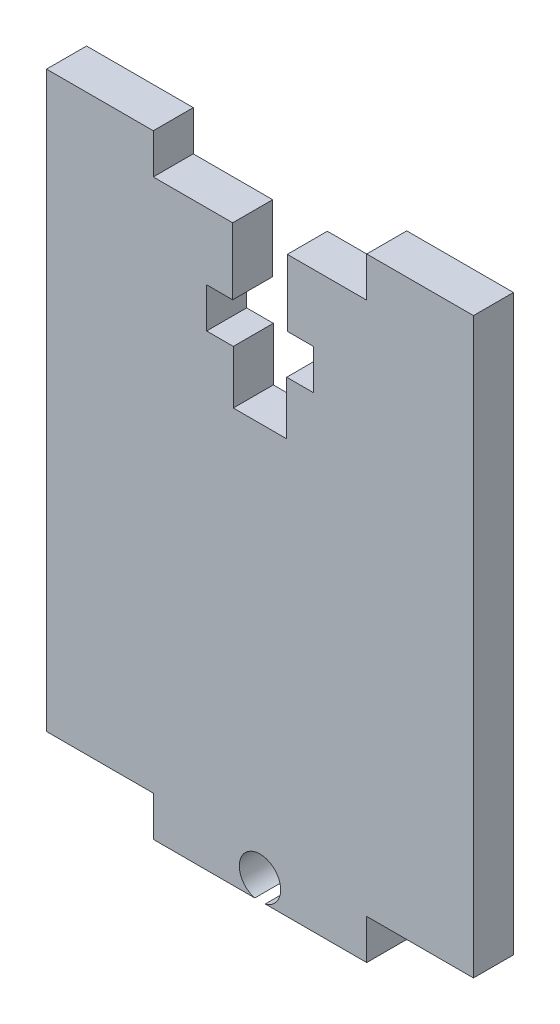
ISO-10303-21;
HEADER;
FILE_DESCRIPTION(('STEP AP214'),'2;1');
FILE_NAME('part.step','',(''),(''),'','','');
FILE_SCHEMA(('AUTOMOTIVE_DESIGN { 1 0 10303 214 1 1 1 1 }'));
ENDSEC;
DATA;
#1=APPLICATION_CONTEXT('core data for automotive mechanical design processes');
#2=APPLICATION_PROTOCOL_DEFINITION('international standard','automotive_design',2000,#1);
#3=PRODUCT_CONTEXT('',#1,'mechanical');
#4=PRODUCT('Part','Part','',(#3));
#5=PRODUCT_RELATED_PRODUCT_CATEGORY('part','',(#4));
#6=PRODUCT_DEFINITION_FORMATION('','',#4);
#7=PRODUCT_DEFINITION_CONTEXT('part definition',#1,'design');
#8=PRODUCT_DEFINITION('design','',#6,#7);
#9=PRODUCT_DEFINITION_SHAPE('','',#8);
#10=(LENGTH_UNIT() NAMED_UNIT(*) SI_UNIT(.MILLI.,.METRE.));
#11=(NAMED_UNIT(*) PLANE_ANGLE_UNIT() SI_UNIT($,.RADIAN.));
#12=(NAMED_UNIT(*) SI_UNIT($,.STERADIAN.) SOLID_ANGLE_UNIT());
#13=UNCERTAINTY_MEASURE_WITH_UNIT(LENGTH_MEASURE(1.E-05),#10,'distance_accuracy_value','');
#14=(GEOMETRIC_REPRESENTATION_CONTEXT(3) GLOBAL_UNCERTAINTY_ASSIGNED_CONTEXT((#13)) GLOBAL_UNIT_ASSIGNED_CONTEXT((#10,
#11,#12)) REPRESENTATION_CONTEXT('',''));
#15=CARTESIAN_POINT('',(0.,0.,0.));
#16=DIRECTION('',(0.,0.,1.));
#17=DIRECTION('',(1.,0.,0.));
#18=AXIS2_PLACEMENT_3D('',#15,#16,#17);
#19=CARTESIAN_POINT('',(8.,48.8553054771042,3.));
#20=DIRECTION('',(1.,0.,0.));
#21=DIRECTION('',(0.,0.,-1.));
#22=AXIS2_PLACEMENT_3D('',#19,#20,#21);
#23=PLANE('',#22);
#24=DIRECTION('',(0.,-1.,0.));
#25=VECTOR('',#24,1.);
#26=CARTESIAN_POINT('',(8.,48.8553054771042,0.));
#27=LINE('',#26,#25);
#28=CARTESIAN_POINT('',(8.,51.8553054771042,0.));
#29=VERTEX_POINT('',#28);
#30=CARTESIAN_POINT('',(8.,48.8553054771042,0.));
#31=VERTEX_POINT('',#30);
#32=EDGE_CURVE('E237',#29,#31,#27,.T.);
#33=ORIENTED_EDGE('',*,*,#32,.T.);
#34=DIRECTION('',(0.,0.,-1.));
#35=VECTOR('',#34,1.);
#36=CARTESIAN_POINT('',(8.,48.8553054771042,3.));
#37=LINE('',#36,#35);
#38=CARTESIAN_POINT('',(8.,48.8553054771042,3.));
#39=VERTEX_POINT('',#38);
#40=EDGE_CURVE('E11',#39,#31,#37,.T.);
#41=ORIENTED_EDGE('',*,*,#40,.F.);
#42=DIRECTION('',(0.,-1.,0.));
#43=VECTOR('',#42,1.);
#44=CARTESIAN_POINT('',(8.,48.8553054771042,3.));
#45=LINE('',#44,#43);
#46=CARTESIAN_POINT('',(8.,51.8553054771042,3.));
#47=VERTEX_POINT('',#46);
#48=EDGE_CURVE('E287',#47,#39,#45,.T.);
#49=ORIENTED_EDGE('',*,*,#48,.F.);
#50=DIRECTION('',(0.,0.,-1.));
#51=VECTOR('',#50,1.);
#52=CARTESIAN_POINT('',(8.,51.8553054771042,3.));
#53=LINE('',#52,#51);
#54=EDGE_CURVE('E233',#47,#29,#53,.T.);
#55=ORIENTED_EDGE('',*,*,#54,.T.);
#56=EDGE_LOOP('',(#33,#41,#49,#55));
#57=FACE_BOUND('',#56,.T.);
#58=ADVANCED_FACE('F33',(#57),#23,.F.);
#59=CARTESIAN_POINT('',(2.04789002341845,48.8553054771042,3.));
#60=DIRECTION('',(0.,-1.,0.));
#61=DIRECTION('',(0.,0.,-1.));
#62=AXIS2_PLACEMENT_3D('',#59,#60,#61);
#63=PLANE('',#62);
#64=DIRECTION('',(-1.,0.,0.));
#65=VECTOR('',#64,1.);
#66=CARTESIAN_POINT('',(2.04789002341845,48.8553054771042,0.));
#67=LINE('',#66,#65);
#68=CARTESIAN_POINT('',(2.04789002341845,48.8553054771042,0.));
#69=VERTEX_POINT('',#68);
#70=EDGE_CURVE('E240',#31,#69,#67,.T.);
#71=ORIENTED_EDGE('',*,*,#70,.T.);
#72=DIRECTION('',(0.,0.,-1.));
#73=VECTOR('',#72,1.);
#74=CARTESIAN_POINT('',(2.04789002341845,48.8553054771042,3.));
#75=LINE('',#74,#73);
#76=CARTESIAN_POINT('',(2.04789002341845,48.8553054771042,3.));
#77=VERTEX_POINT('',#76);
#78=EDGE_CURVE('E41',#77,#69,#75,.T.);
#79=ORIENTED_EDGE('',*,*,#78,.F.);
#80=DIRECTION('',(-1.,0.,0.));
#81=VECTOR('',#80,1.);
#82=CARTESIAN_POINT('',(2.04789002341845,48.8553054771042,3.));
#83=LINE('',#82,#81);
#84=EDGE_CURVE('E146',#39,#77,#83,.T.);
#85=ORIENTED_EDGE('',*,*,#84,.F.);
#86=ORIENTED_EDGE('',*,*,#40,.T.);
#87=EDGE_LOOP('',(#71,#79,#85,#86));
#88=FACE_BOUND('',#87,.T.);
#89=ADVANCED_FACE('F435',(#88),#63,.F.);
#90=CARTESIAN_POINT('',(2.04789002341845,48.8553054771042,3.));
#91=DIRECTION('',(1.,0.,0.));
#92=DIRECTION('',(0.,1.,0.));
#93=AXIS2_PLACEMENT_3D('',#90,#91,#92);
#94=PLANE('',#93);
#95=DIRECTION('',(0.,-1.,0.));
#96=VECTOR('',#95,1.);
#97=CARTESIAN_POINT('',(2.04789002341845,48.8553054771042,0.));
#98=LINE('',#97,#96);
#99=CARTESIAN_POINT('',(2.04789002341845,43.8553054771042,0.));
#100=VERTEX_POINT('',#99);
#101=EDGE_CURVE('E242',#69,#100,#98,.T.);
#102=ORIENTED_EDGE('',*,*,#101,.T.);
#103=DIRECTION('',(0.,0.,-1.));
#104=VECTOR('',#103,1.);
#105=CARTESIAN_POINT('',(2.04789002341845,43.8553054771042,3.));
#106=LINE('',#105,#104);
#107=CARTESIAN_POINT('',(2.04789002341845,43.8553054771042,3.));
#108=VERTEX_POINT('',#107);
#109=EDGE_CURVE('E348',#108,#100,#106,.T.);
#110=ORIENTED_EDGE('',*,*,#109,.F.);
#111=DIRECTION('',(0.,-1.,0.));
#112=VECTOR('',#111,1.);
#113=CARTESIAN_POINT('',(2.04789002341845,48.8553054771042,3.));
#114=LINE('',#113,#112);
#115=EDGE_CURVE('E356',#77,#108,#114,.T.);
#116=ORIENTED_EDGE('',*,*,#115,.F.);
#117=ORIENTED_EDGE('',*,*,#78,.T.);
#118=EDGE_LOOP('',(#102,#110,#116,#117));
#119=FACE_BOUND('',#118,.T.);
#120=ADVANCED_FACE('F354',(#119),#94,.F.);
#121=CARTESIAN_POINT('',(2.04789002341845,43.8553054771042,3.));
#122=DIRECTION('',(0.,1.,0.));
#123=DIRECTION('',(-1.,0.,0.));
#124=AXIS2_PLACEMENT_3D('',#121,#122,#123);
#125=PLANE('',#124);
#126=DIRECTION('',(1.,0.,0.));
#127=VECTOR('',#126,1.);
#128=CARTESIAN_POINT('',(2.04789002341845,43.8553054771042,0.));
#129=LINE('',#128,#127);
#130=CARTESIAN_POINT('',(4.,43.8553054771042,0.));
#131=VERTEX_POINT('',#130);
#132=EDGE_CURVE('E244',#100,#131,#129,.T.);
#133=ORIENTED_EDGE('',*,*,#132,.T.);
#134=DIRECTION('',(0.,0.,-1.));
#135=VECTOR('',#134,1.);
#136=CARTESIAN_POINT('',(4.,43.8553054771042,3.));
#137=LINE('',#136,#135);
#138=CARTESIAN_POINT('',(4.,43.8553054771042,3.));
#139=VERTEX_POINT('',#138);
#140=EDGE_CURVE('E345',#139,#131,#137,.T.);
#141=ORIENTED_EDGE('',*,*,#140,.F.);
#142=DIRECTION('',(1.,0.,0.));
#143=VECTOR('',#142,1.);
#144=CARTESIAN_POINT('',(2.04789002341845,43.8553054771042,3.));
#145=LINE('',#144,#143);
#146=EDGE_CURVE('E374',#108,#139,#145,.T.);
#147=ORIENTED_EDGE('',*,*,#146,.F.);
#148=ORIENTED_EDGE('',*,*,#109,.T.);
#149=EDGE_LOOP('',(#133,#141,#147,#148));
#150=FACE_BOUND('',#149,.T.);
#151=ADVANCED_FACE('F365',(#150),#125,.F.);
#152=CARTESIAN_POINT('',(4.,43.8553054771042,3.));
#153=DIRECTION('',(1.,0.,0.));
#154=DIRECTION('',(0.,1.,0.));
#155=AXIS2_PLACEMENT_3D('',#152,#153,#154);
#156=PLANE('',#155);
#157=DIRECTION('',(0.,-1.,0.));
#158=VECTOR('',#157,1.);
#159=CARTESIAN_POINT('',(4.,43.8553054771042,0.));
#160=LINE('',#159,#158);
#161=CARTESIAN_POINT('',(4.,40.8553054771042,0.));
#162=VERTEX_POINT('',#161);
#163=EDGE_CURVE('E246',#131,#162,#160,.T.);
#164=ORIENTED_EDGE('',*,*,#163,.T.);
#165=DIRECTION('',(0.,0.,-1.));
#166=VECTOR('',#165,1.);
#167=CARTESIAN_POINT('',(4.,40.8553054771042,3.));
#168=LINE('',#167,#166);
#169=CARTESIAN_POINT('',(4.,40.8553054771042,3.));
#170=VERTEX_POINT('',#169);
#171=EDGE_CURVE('E342',#170,#162,#168,.T.);
#172=ORIENTED_EDGE('',*,*,#171,.F.);
#173=DIRECTION('',(0.,-1.,0.));
#174=VECTOR('',#173,1.);
#175=CARTESIAN_POINT('',(4.,43.8553054771042,3.));
#176=LINE('',#175,#174);
#177=EDGE_CURVE('E371',#139,#170,#176,.T.);
#178=ORIENTED_EDGE('',*,*,#177,.F.);
#179=ORIENTED_EDGE('',*,*,#140,.T.);
#180=EDGE_LOOP('',(#164,#172,#178,#179));
#181=FACE_BOUND('',#180,.T.);
#182=ADVANCED_FACE('F369',(#181),#156,.F.);
#183=CARTESIAN_POINT('',(4.,40.8553054771042,3.));
#184=DIRECTION('',(0.,-1.,0.));
#185=DIRECTION('',(0.,0.,-1.));
#186=AXIS2_PLACEMENT_3D('',#183,#184,#185);
#187=PLANE('',#186);
#188=DIRECTION('',(-1.,0.,0.));
#189=VECTOR('',#188,1.);
#190=CARTESIAN_POINT('',(4.,40.8553054771042,0.));
#191=LINE('',#190,#189);
#192=CARTESIAN_POINT('',(2.,40.8553054771042,0.));
#193=VERTEX_POINT('',#192);
#194=EDGE_CURVE('E248',#162,#193,#191,.T.);
#195=ORIENTED_EDGE('',*,*,#194,.T.);
#196=DIRECTION('',(0.,0.,-1.));
#197=VECTOR('',#196,1.);
#198=CARTESIAN_POINT('',(2.,40.8553054771042,3.));
#199=LINE('',#198,#197);
#200=CARTESIAN_POINT('',(2.,40.8553054771042,3.));
#201=VERTEX_POINT('',#200);
#202=EDGE_CURVE('E339',#201,#193,#199,.T.);
#203=ORIENTED_EDGE('',*,*,#202,.F.);
#204=DIRECTION('',(-1.,0.,0.));
#205=VECTOR('',#204,1.);
#206=CARTESIAN_POINT('',(4.,40.8553054771042,3.));
#207=LINE('',#206,#205);
#208=EDGE_CURVE('E373',#170,#201,#207,.T.);
#209=ORIENTED_EDGE('',*,*,#208,.F.);
#210=ORIENTED_EDGE('',*,*,#171,.T.);
#211=EDGE_LOOP('',(#195,#203,#209,#210));
#212=FACE_BOUND('',#211,.T.);
#213=ADVANCED_FACE('F448',(#212),#187,.F.);
#214=CARTESIAN_POINT('',(2.,40.8553054771042,3.));
#215=DIRECTION('',(1.,0.,0.));
#216=DIRECTION('',(0.,1.,0.));
#217=AXIS2_PLACEMENT_3D('',#214,#215,#216);
#218=PLANE('',#217);
#219=DIRECTION('',(0.,-1.,0.));
#220=VECTOR('',#219,1.);
#221=CARTESIAN_POINT('',(2.,40.8553054771042,0.));
#222=LINE('',#221,#220);
#223=CARTESIAN_POINT('',(2.,36.8553054771042,0.));
#224=VERTEX_POINT('',#223);
#225=EDGE_CURVE('E250',#193,#224,#222,.T.);
#226=ORIENTED_EDGE('',*,*,#225,.T.);
#227=DIRECTION('',(0.,0.,-1.));
#228=VECTOR('',#227,1.);
#229=CARTESIAN_POINT('',(2.,36.8553054771042,3.));
#230=LINE('',#229,#228);
#231=CARTESIAN_POINT('',(2.,36.8553054771042,3.));
#232=VERTEX_POINT('',#231);
#233=EDGE_CURVE('E336',#232,#224,#230,.T.);
#234=ORIENTED_EDGE('',*,*,#233,.F.);
#235=DIRECTION('',(0.,-1.,0.));
#236=VECTOR('',#235,1.);
#237=CARTESIAN_POINT('',(2.,40.8553054771042,3.));
#238=LINE('',#237,#236);
#239=EDGE_CURVE('E376',#201,#232,#238,.T.);
#240=ORIENTED_EDGE('',*,*,#239,.F.);
#241=ORIENTED_EDGE('',*,*,#202,.T.);
#242=EDGE_LOOP('',(#226,#234,#240,#241));
#243=FACE_BOUND('',#242,.T.);
#244=ADVANCED_FACE('F451',(#243),#218,.F.);
#245=CARTESIAN_POINT('',(2.,36.8553054771042,3.));
#246=DIRECTION('',(0.,-1.,0.));
#247=DIRECTION('',(0.,0.,-1.));
#248=AXIS2_PLACEMENT_3D('',#245,#246,#247);
#249=PLANE('',#248);
#250=DIRECTION('',(-1.,0.,0.));
#251=VECTOR('',#250,1.);
#252=CARTESIAN_POINT('',(2.,36.8553054771042,0.));
#253=LINE('',#252,#251);
#254=CARTESIAN_POINT('',(-2.,36.8553054771042,0.));
#255=VERTEX_POINT('',#254);
#256=EDGE_CURVE('E252',#224,#255,#253,.T.);
#257=ORIENTED_EDGE('',*,*,#256,.T.);
#258=DIRECTION('',(0.,0.,-1.));
#259=VECTOR('',#258,1.);
#260=CARTESIAN_POINT('',(-2.,36.8553054771042,3.));
#261=LINE('',#260,#259);
#262=CARTESIAN_POINT('',(-2.,36.8553054771042,3.));
#263=VERTEX_POINT('',#262);
#264=EDGE_CURVE('E333',#263,#255,#261,.T.);
#265=ORIENTED_EDGE('',*,*,#264,.F.);
#266=DIRECTION('',(-1.,0.,0.));
#267=VECTOR('',#266,1.);
#268=CARTESIAN_POINT('',(2.,36.8553054771042,3.));
#269=LINE('',#268,#267);
#270=EDGE_CURVE('E382',#232,#263,#269,.T.);
#271=ORIENTED_EDGE('',*,*,#270,.F.);
#272=ORIENTED_EDGE('',*,*,#233,.T.);
#273=EDGE_LOOP('',(#257,#265,#271,#272));
#274=FACE_BOUND('',#273,.T.);
#275=ADVANCED_FACE('F455',(#274),#249,.F.);
#276=CARTESIAN_POINT('',(-2.,40.8553054771042,3.));
#277=DIRECTION('',(-1.,0.,0.));
#278=DIRECTION('',(0.,-1.,0.));
#279=AXIS2_PLACEMENT_3D('',#276,#277,#278);
#280=PLANE('',#279);
#281=DIRECTION('',(0.,1.,0.));
#282=VECTOR('',#281,1.);
#283=CARTESIAN_POINT('',(-2.,40.8553054771042,0.));
#284=LINE('',#283,#282);
#285=CARTESIAN_POINT('',(-2.,40.8553054771042,0.));
#286=VERTEX_POINT('',#285);
#287=EDGE_CURVE('E254',#255,#286,#284,.T.);
#288=ORIENTED_EDGE('',*,*,#287,.T.);
#289=DIRECTION('',(0.,0.,-1.));
#290=VECTOR('',#289,1.);
#291=CARTESIAN_POINT('',(-2.,40.8553054771042,3.));
#292=LINE('',#291,#290);
#293=CARTESIAN_POINT('',(-2.,40.8553054771042,3.));
#294=VERTEX_POINT('',#293);
#295=EDGE_CURVE('E330',#294,#286,#292,.T.);
#296=ORIENTED_EDGE('',*,*,#295,.F.);
#297=DIRECTION('',(0.,1.,0.));
#298=VECTOR('',#297,1.);
#299=CARTESIAN_POINT('',(-2.,40.8553054771042,3.));
#300=LINE('',#299,#298);
#301=EDGE_CURVE('E384',#263,#294,#300,.T.);
#302=ORIENTED_EDGE('',*,*,#301,.F.);
#303=ORIENTED_EDGE('',*,*,#264,.T.);
#304=EDGE_LOOP('',(#288,#296,#302,#303));
#305=FACE_BOUND('',#304,.T.);
#306=ADVANCED_FACE('F459',(#305),#280,.F.);
#307=CARTESIAN_POINT('',(-4.00000000000001,40.8553054771042,3.));
#308=DIRECTION('',(0.,-1.,0.));
#309=DIRECTION('',(0.,0.,-1.));
#310=AXIS2_PLACEMENT_3D('',#307,#308,#309);
#311=PLANE('',#310);
#312=DIRECTION('',(-1.,0.,0.));
#313=VECTOR('',#312,1.);
#314=CARTESIAN_POINT('',(-4.00000000000001,40.8553054771042,0.));
#315=LINE('',#314,#313);
#316=CARTESIAN_POINT('',(-4.00000000000001,40.8553054771042,0.));
#317=VERTEX_POINT('',#316);
#318=EDGE_CURVE('E256',#286,#317,#315,.T.);
#319=ORIENTED_EDGE('',*,*,#318,.T.);
#320=DIRECTION('',(0.,0.,-1.));
#321=VECTOR('',#320,1.);
#322=CARTESIAN_POINT('',(-4.00000000000001,40.8553054771042,3.));
#323=LINE('',#322,#321);
#324=CARTESIAN_POINT('',(-4.00000000000001,40.8553054771042,3.));
#325=VERTEX_POINT('',#324);
#326=EDGE_CURVE('E327',#325,#317,#323,.T.);
#327=ORIENTED_EDGE('',*,*,#326,.F.);
#328=DIRECTION('',(-1.,0.,0.));
#329=VECTOR('',#328,1.);
#330=CARTESIAN_POINT('',(-4.00000000000001,40.8553054771042,3.));
#331=LINE('',#330,#329);
#332=EDGE_CURVE('E386',#294,#325,#331,.T.);
#333=ORIENTED_EDGE('',*,*,#332,.F.);
#334=ORIENTED_EDGE('',*,*,#295,.T.);
#335=EDGE_LOOP('',(#319,#327,#333,#334));
#336=FACE_BOUND('',#335,.T.);
#337=ADVANCED_FACE('F463',(#336),#311,.F.);
#338=CARTESIAN_POINT('',(-4.,43.8553054771042,3.));
#339=DIRECTION('',(-1.,0.,0.));
#340=DIRECTION('',(0.,-1.,0.));
#341=AXIS2_PLACEMENT_3D('',#338,#339,#340);
#342=PLANE('',#341);
#343=DIRECTION('',(0.,1.,0.));
#344=VECTOR('',#343,1.);
#345=CARTESIAN_POINT('',(-4.,43.8553054771042,0.));
#346=LINE('',#345,#344);
#347=CARTESIAN_POINT('',(-4.,43.8553054771042,0.));
#348=VERTEX_POINT('',#347);
#349=EDGE_CURVE('E258',#317,#348,#346,.T.);
#350=ORIENTED_EDGE('',*,*,#349,.T.);
#351=DIRECTION('',(0.,0.,-1.));
#352=VECTOR('',#351,1.);
#353=CARTESIAN_POINT('',(-4.,43.8553054771042,3.));
#354=LINE('',#353,#352);
#355=CARTESIAN_POINT('',(-4.,43.8553054771042,3.));
#356=VERTEX_POINT('',#355);
#357=EDGE_CURVE('E324',#356,#348,#354,.T.);
#358=ORIENTED_EDGE('',*,*,#357,.F.);
#359=DIRECTION('',(0.,1.,0.));
#360=VECTOR('',#359,1.);
#361=CARTESIAN_POINT('',(-4.,43.8553054771042,3.));
#362=LINE('',#361,#360);
#363=EDGE_CURVE('E388',#325,#356,#362,.T.);
#364=ORIENTED_EDGE('',*,*,#363,.F.);
#365=ORIENTED_EDGE('',*,*,#326,.T.);
#366=EDGE_LOOP('',(#350,#358,#364,#365));
#367=FACE_BOUND('',#366,.T.);
#368=ADVANCED_FACE('F467',(#367),#342,.F.);
#369=CARTESIAN_POINT('',(-2.04789002341846,43.8553054771042,3.));
#370=DIRECTION('',(0.,1.,0.));
#371=DIRECTION('',(-1.,0.,0.));
#372=AXIS2_PLACEMENT_3D('',#369,#370,#371);
#373=PLANE('',#372);
#374=DIRECTION('',(1.,0.,0.));
#375=VECTOR('',#374,1.);
#376=CARTESIAN_POINT('',(-2.04789002341846,43.8553054771042,0.));
#377=LINE('',#376,#375);
#378=CARTESIAN_POINT('',(-2.04789002341846,43.8553054771042,0.));
#379=VERTEX_POINT('',#378);
#380=EDGE_CURVE('E260',#348,#379,#377,.T.);
#381=ORIENTED_EDGE('',*,*,#380,.T.);
#382=DIRECTION('',(0.,0.,-1.));
#383=VECTOR('',#382,1.);
#384=CARTESIAN_POINT('',(-2.04789002341846,43.8553054771042,3.));
#385=LINE('',#384,#383);
#386=CARTESIAN_POINT('',(-2.04789002341846,43.8553054771042,3.));
#387=VERTEX_POINT('',#386);
#388=EDGE_CURVE('E321',#387,#379,#385,.T.);
#389=ORIENTED_EDGE('',*,*,#388,.F.);
#390=DIRECTION('',(1.,0.,0.));
#391=VECTOR('',#390,1.);
#392=CARTESIAN_POINT('',(-2.04789002341846,43.8553054771042,3.));
#393=LINE('',#392,#391);
#394=EDGE_CURVE('E390',#356,#387,#393,.T.);
#395=ORIENTED_EDGE('',*,*,#394,.F.);
#396=ORIENTED_EDGE('',*,*,#357,.T.);
#397=EDGE_LOOP('',(#381,#389,#395,#396));
#398=FACE_BOUND('',#397,.T.);
#399=ADVANCED_FACE('F471',(#398),#373,.F.);
#400=CARTESIAN_POINT('',(-2.04789002341846,48.8553054771042,3.));
#401=DIRECTION('',(-1.,0.,0.));
#402=DIRECTION('',(0.,-1.,0.));
#403=AXIS2_PLACEMENT_3D('',#400,#401,#402);
#404=PLANE('',#403);
#405=DIRECTION('',(0.,1.,0.));
#406=VECTOR('',#405,1.);
#407=CARTESIAN_POINT('',(-2.04789002341846,48.8553054771042,0.));
#408=LINE('',#407,#406);
#409=CARTESIAN_POINT('',(-2.04789002341846,48.8553054771042,0.));
#410=VERTEX_POINT('',#409);
#411=EDGE_CURVE('E262',#379,#410,#408,.T.);
#412=ORIENTED_EDGE('',*,*,#411,.T.);
#413=DIRECTION('',(0.,0.,-1.));
#414=VECTOR('',#413,1.);
#415=CARTESIAN_POINT('',(-2.04789002341846,48.8553054771042,3.));
#416=LINE('',#415,#414);
#417=CARTESIAN_POINT('',(-2.04789002341846,48.8553054771042,3.));
#418=VERTEX_POINT('',#417);
#419=EDGE_CURVE('E318',#418,#410,#416,.T.);
#420=ORIENTED_EDGE('',*,*,#419,.F.);
#421=DIRECTION('',(0.,1.,0.));
#422=VECTOR('',#421,1.);
#423=CARTESIAN_POINT('',(-2.04789002341846,48.8553054771042,3.));
#424=LINE('',#423,#422);
#425=EDGE_CURVE('E392',#387,#418,#424,.T.);
#426=ORIENTED_EDGE('',*,*,#425,.F.);
#427=ORIENTED_EDGE('',*,*,#388,.T.);
#428=EDGE_LOOP('',(#412,#420,#426,#427));
#429=FACE_BOUND('',#428,.T.);
#430=ADVANCED_FACE('F475',(#429),#404,.F.);
#431=CARTESIAN_POINT('',(-2.04789002341846,48.8553054771042,3.));
#432=DIRECTION('',(0.,-1.,0.));
#433=DIRECTION('',(0.,0.,-1.));
#434=AXIS2_PLACEMENT_3D('',#431,#432,#433);
#435=PLANE('',#434);
#436=DIRECTION('',(-1.,0.,0.));
#437=VECTOR('',#436,1.);
#438=CARTESIAN_POINT('',(-2.04789002341846,48.8553054771042,0.));
#439=LINE('',#438,#437);
#440=CARTESIAN_POINT('',(-8.00000000000001,48.8553054771042,0.));
#441=VERTEX_POINT('',#440);
#442=EDGE_CURVE('E264',#410,#441,#439,.T.);
#443=ORIENTED_EDGE('',*,*,#442,.T.);
#444=DIRECTION('',(0.,0.,-1.));
#445=VECTOR('',#444,1.);
#446=CARTESIAN_POINT('',(-8.00000000000001,48.8553054771042,3.));
#447=LINE('',#446,#445);
#448=CARTESIAN_POINT('',(-8.00000000000001,48.8553054771042,3.));
#449=VERTEX_POINT('',#448);
#450=EDGE_CURVE('E315',#449,#441,#447,.T.);
#451=ORIENTED_EDGE('',*,*,#450,.F.);
#452=DIRECTION('',(-1.,0.,0.));
#453=VECTOR('',#452,1.);
#454=CARTESIAN_POINT('',(-2.04789002341846,48.8553054771042,3.));
#455=LINE('',#454,#453);
#456=EDGE_CURVE('E394',#418,#449,#455,.T.);
#457=ORIENTED_EDGE('',*,*,#456,.F.);
#458=ORIENTED_EDGE('',*,*,#419,.T.);
#459=EDGE_LOOP('',(#443,#451,#457,#458));
#460=FACE_BOUND('',#459,.T.);
#461=ADVANCED_FACE('F479',(#460),#435,.F.);
#462=CARTESIAN_POINT('',(-8.00000000000001,48.8553054771042,3.));
#463=DIRECTION('',(-1.,0.,0.));
#464=DIRECTION('',(0.,0.,1.));
#465=AXIS2_PLACEMENT_3D('',#462,#463,#464);
#466=PLANE('',#465);
#467=DIRECTION('',(0.,1.,0.));
#468=VECTOR('',#467,1.);
#469=CARTESIAN_POINT('',(-8.00000000000001,48.8553054771042,0.));
#470=LINE('',#469,#468);
#471=CARTESIAN_POINT('',(-8.00000000000001,51.8553054771042,0.));
#472=VERTEX_POINT('',#471);
#473=EDGE_CURVE('E266',#441,#472,#470,.T.);
#474=ORIENTED_EDGE('',*,*,#473,.T.);
#475=DIRECTION('',(0.,0.,-1.));
#476=VECTOR('',#475,1.);
#477=CARTESIAN_POINT('',(-8.00000000000001,51.8553054771042,3.));
#478=LINE('',#477,#476);
#479=CARTESIAN_POINT('',(-8.00000000000001,51.8553054771042,3.));
#480=VERTEX_POINT('',#479);
#481=EDGE_CURVE('E312',#480,#472,#478,.T.);
#482=ORIENTED_EDGE('',*,*,#481,.F.);
#483=DIRECTION('',(0.,1.,0.));
#484=VECTOR('',#483,1.);
#485=CARTESIAN_POINT('',(-8.00000000000001,48.8553054771042,3.));
#486=LINE('',#485,#484);
#487=EDGE_CURVE('E396',#449,#480,#486,.T.);
#488=ORIENTED_EDGE('',*,*,#487,.F.);
#489=ORIENTED_EDGE('',*,*,#450,.T.);
#490=EDGE_LOOP('',(#474,#482,#488,#489));
#491=FACE_BOUND('',#490,.T.);
#492=ADVANCED_FACE('F483',(#491),#466,.F.);
#493=CARTESIAN_POINT('',(-8.00000000000001,51.8553054771042,3.));
#494=DIRECTION('',(0.,-1.,0.));
#495=DIRECTION('',(0.,0.,-1.));
#496=AXIS2_PLACEMENT_3D('',#493,#494,#495);
#497=PLANE('',#496);
#498=DIRECTION('',(-1.,0.,0.));
#499=VECTOR('',#498,1.);
#500=CARTESIAN_POINT('',(-8.00000000000001,51.8553054771042,0.));
#501=LINE('',#500,#499);
#502=CARTESIAN_POINT('',(-16.,51.8553054771042,0.));
#503=VERTEX_POINT('',#502);
#504=EDGE_CURVE('E268',#472,#503,#501,.T.);
#505=ORIENTED_EDGE('',*,*,#504,.T.);
#506=DIRECTION('',(0.,0.,-1.));
#507=VECTOR('',#506,1.);
#508=CARTESIAN_POINT('',(-16.,51.8553054771042,3.));
#509=LINE('',#508,#507);
#510=CARTESIAN_POINT('',(-16.,51.8553054771042,3.));
#511=VERTEX_POINT('',#510);
#512=EDGE_CURVE('E309',#511,#503,#509,.T.);
#513=ORIENTED_EDGE('',*,*,#512,.F.);
#514=DIRECTION('',(-1.,0.,0.));
#515=VECTOR('',#514,1.);
#516=CARTESIAN_POINT('',(-8.00000000000001,51.8553054771042,3.));
#517=LINE('',#516,#515);
#518=EDGE_CURVE('E398',#480,#511,#517,.T.);
#519=ORIENTED_EDGE('',*,*,#518,.F.);
#520=ORIENTED_EDGE('',*,*,#481,.T.);
#521=EDGE_LOOP('',(#505,#513,#519,#520));
#522=FACE_BOUND('',#521,.T.);
#523=ADVANCED_FACE('F487',(#522),#497,.F.);
#524=CARTESIAN_POINT('',(-16.,51.8553054771042,3.));
#525=DIRECTION('',(1.,0.,0.));
#526=DIRECTION('',(0.,1.,0.));
#527=AXIS2_PLACEMENT_3D('',#524,#525,#526);
#528=PLANE('',#527);
#529=DIRECTION('',(0.,-1.,0.));
#530=VECTOR('',#529,1.);
#531=CARTESIAN_POINT('',(-16.,51.8553054771042,0.));
#532=LINE('',#531,#530);
#533=CARTESIAN_POINT('',(-16.,8.85530547710422,0.));
#534=VERTEX_POINT('',#533);
#535=EDGE_CURVE('E270',#503,#534,#532,.T.);
#536=ORIENTED_EDGE('',*,*,#535,.T.);
#537=DIRECTION('',(0.,0.,-1.));
#538=VECTOR('',#537,1.);
#539=CARTESIAN_POINT('',(-16.,8.85530547710422,3.));
#540=LINE('',#539,#538);
#541=CARTESIAN_POINT('',(-16.,8.85530547710422,3.));
#542=VERTEX_POINT('',#541);
#543=EDGE_CURVE('E306',#542,#534,#540,.T.);
#544=ORIENTED_EDGE('',*,*,#543,.F.);
#545=DIRECTION('',(0.,-1.,0.));
#546=VECTOR('',#545,1.);
#547=CARTESIAN_POINT('',(-16.,51.8553054771042,3.));
#548=LINE('',#547,#546);
#549=EDGE_CURVE('E400',#511,#542,#548,.T.);
#550=ORIENTED_EDGE('',*,*,#549,.F.);
#551=ORIENTED_EDGE('',*,*,#512,.T.);
#552=EDGE_LOOP('',(#536,#544,#550,#551));
#553=FACE_BOUND('',#552,.T.);
#554=ADVANCED_FACE('F491',(#553),#528,.F.);
#555=CARTESIAN_POINT('',(-16.,8.85530547710422,3.));
#556=DIRECTION('',(0.,1.,0.));
#557=DIRECTION('',(0.,0.,1.));
#558=AXIS2_PLACEMENT_3D('',#555,#556,#557);
#559=PLANE('',#558);
#560=DIRECTION('',(1.,0.,0.));
#561=VECTOR('',#560,1.);
#562=CARTESIAN_POINT('',(-16.,8.85530547710422,0.));
#563=LINE('',#562,#561);
#564=CARTESIAN_POINT('',(-8.00000000000001,8.85530547710422,0.));
#565=VERTEX_POINT('',#564);
#566=EDGE_CURVE('E272',#534,#565,#563,.T.);
#567=ORIENTED_EDGE('',*,*,#566,.T.);
#568=DIRECTION('',(0.,0.,-1.));
#569=VECTOR('',#568,1.);
#570=CARTESIAN_POINT('',(-8.00000000000001,8.85530547710422,3.));
#571=LINE('',#570,#569);
#572=CARTESIAN_POINT('',(-8.00000000000001,8.85530547710422,3.));
#573=VERTEX_POINT('',#572);
#574=EDGE_CURVE('E303',#573,#565,#571,.T.);
#575=ORIENTED_EDGE('',*,*,#574,.F.);
#576=DIRECTION('',(1.,0.,0.));
#577=VECTOR('',#576,1.);
#578=CARTESIAN_POINT('',(-16.,8.85530547710422,3.));
#579=LINE('',#578,#577);
#580=EDGE_CURVE('E402',#542,#573,#579,.T.);
#581=ORIENTED_EDGE('',*,*,#580,.F.);
#582=ORIENTED_EDGE('',*,*,#543,.T.);
#583=EDGE_LOOP('',(#567,#575,#581,#582));
#584=FACE_BOUND('',#583,.T.);
#585=ADVANCED_FACE('F495',(#584),#559,.F.);
#586=CARTESIAN_POINT('',(-8.00000000000001,5.85530547710422,3.));
#587=DIRECTION('',(1.,0.,0.));
#588=DIRECTION('',(0.,0.,-1.));
#589=AXIS2_PLACEMENT_3D('',#586,#587,#588);
#590=PLANE('',#589);
#591=DIRECTION('',(0.,-1.,0.));
#592=VECTOR('',#591,1.);
#593=CARTESIAN_POINT('',(-8.00000000000001,5.85530547710422,0.));
#594=LINE('',#593,#592);
#595=CARTESIAN_POINT('',(-8.00000000000001,5.85530547710422,0.));
#596=VERTEX_POINT('',#595);
#597=EDGE_CURVE('E274',#565,#596,#594,.T.);
#598=ORIENTED_EDGE('',*,*,#597,.T.);
#599=DIRECTION('',(0.,0.,-1.));
#600=VECTOR('',#599,1.);
#601=CARTESIAN_POINT('',(-8.00000000000001,5.85530547710422,3.));
#602=LINE('',#601,#600);
#603=CARTESIAN_POINT('',(-8.00000000000001,5.85530547710422,3.));
#604=VERTEX_POINT('',#603);
#605=EDGE_CURVE('E300',#604,#596,#602,.T.);
#606=ORIENTED_EDGE('',*,*,#605,.F.);
#607=DIRECTION('',(0.,-1.,0.));
#608=VECTOR('',#607,1.);
#609=CARTESIAN_POINT('',(-8.00000000000001,5.85530547710422,3.));
#610=LINE('',#609,#608);
#611=EDGE_CURVE('E404',#573,#604,#610,.T.);
#612=ORIENTED_EDGE('',*,*,#611,.F.);
#613=ORIENTED_EDGE('',*,*,#574,.T.);
#614=EDGE_LOOP('',(#598,#606,#612,#613));
#615=FACE_BOUND('',#614,.T.);
#616=ADVANCED_FACE('F499',(#615),#590,.F.);
#617=CARTESIAN_POINT('',(-8.00000000000001,5.85530547710422,3.));
#618=DIRECTION('',(0.,1.,0.));
#619=DIRECTION('',(0.,0.,1.));
#620=AXIS2_PLACEMENT_3D('',#617,#618,#619);
#621=PLANE('',#620);
#622=DIRECTION('',(1.,0.,0.));
#623=VECTOR('',#622,1.);
#624=CARTESIAN_POINT('',(-8.00000000000001,5.85530547710422,0.));
#625=LINE('',#624,#623);
#626=CARTESIAN_POINT('',(-0.390512483795329,5.85530547710422,0.));
#627=VERTEX_POINT('',#626);
#628=EDGE_CURVE('E276',#596,#627,#625,.T.);
#629=ORIENTED_EDGE('',*,*,#628,.T.);
#630=DIRECTION('',(0.,0.,-1.));
#631=VECTOR('',#630,1.);
#632=CARTESIAN_POINT('',(-0.390512483795329,5.85530547710422,3.));
#633=LINE('',#632,#631);
#634=CARTESIAN_POINT('',(-0.390512483795329,5.85530547710422,3.));
#635=VERTEX_POINT('',#634);
#636=EDGE_CURVE('E297',#635,#627,#633,.T.);
#637=ORIENTED_EDGE('',*,*,#636,.F.);
#638=DIRECTION('',(1.,0.,0.));
#639=VECTOR('',#638,1.);
#640=CARTESIAN_POINT('',(-8.00000000000001,5.85530547710422,3.));
#641=LINE('',#640,#639);
#642=EDGE_CURVE('E406',#604,#635,#641,.T.);
#643=ORIENTED_EDGE('',*,*,#642,.F.);
#644=ORIENTED_EDGE('',*,*,#605,.T.);
#645=EDGE_LOOP('',(#629,#637,#643,#644));
#646=FACE_BOUND('',#645,.T.);
#647=ADVANCED_FACE('F503',(#646),#621,.F.);
#648=CARTESIAN_POINT('',(0.,7.35530547710422,3.));
#649=DIRECTION('',(0.,0.,-1.));
#650=DIRECTION('',(-1.,0.,0.));
#651=AXIS2_PLACEMENT_3D('',#648,#649,#650);
#652=CYLINDRICAL_SURFACE('',#651,1.55);
#653=CARTESIAN_POINT('',(0.,7.35530547710422,0.));
#654=DIRECTION('',(0.,0.,-1.));
#655=DIRECTION('',(1.,0.,0.));
#656=AXIS2_PLACEMENT_3D('',#653,#654,#655);
#657=CIRCLE('',#656,1.55);
#658=CARTESIAN_POINT('',(0.390512483795352,5.85530547710422,0.));
#659=VERTEX_POINT('',#658);
#660=EDGE_CURVE('E278',#627,#659,#657,.T.);
#661=ORIENTED_EDGE('',*,*,#660,.T.);
#662=DIRECTION('',(0.,0.,-1.));
#663=VECTOR('',#662,1.);
#664=CARTESIAN_POINT('',(0.390512483795352,5.85530547710422,3.));
#665=LINE('',#664,#663);
#666=CARTESIAN_POINT('',(0.390512483795352,5.85530547710422,3.));
#667=VERTEX_POINT('',#666);
#668=EDGE_CURVE('E294',#667,#659,#665,.T.);
#669=ORIENTED_EDGE('',*,*,#668,.F.);
#670=CARTESIAN_POINT('',(0.,7.35530547710422,3.));
#671=DIRECTION('',(0.,0.,-1.));
#672=DIRECTION('',(1.,0.,0.));
#673=AXIS2_PLACEMENT_3D('',#670,#671,#672);
#674=CIRCLE('',#673,1.55);
#675=EDGE_CURVE('E408',#635,#667,#674,.T.);
#676=ORIENTED_EDGE('',*,*,#675,.F.);
#677=ORIENTED_EDGE('',*,*,#636,.T.);
#678=EDGE_LOOP('',(#661,#669,#676,#677));
#679=FACE_BOUND('',#678,.T.);
#680=ADVANCED_FACE('F507',(#679),#652,.F.);
#681=CARTESIAN_POINT('',(0.390512483795352,5.85530547710422,3.));
#682=DIRECTION('',(0.,1.,0.));
#683=DIRECTION('',(-1.,0.,0.));
#684=AXIS2_PLACEMENT_3D('',#681,#682,#683);
#685=PLANE('',#684);
#686=DIRECTION('',(1.,0.,0.));
#687=VECTOR('',#686,1.);
#688=CARTESIAN_POINT('',(0.390512483795352,5.85530547710422,0.));
#689=LINE('',#688,#687);
#690=CARTESIAN_POINT('',(8.00000000000004,5.85530547710422,0.));
#691=VERTEX_POINT('',#690);
#692=EDGE_CURVE('E280',#659,#691,#689,.T.);
#693=ORIENTED_EDGE('',*,*,#692,.T.);
#694=DIRECTION('',(0.,0.,-1.));
#695=VECTOR('',#694,1.);
#696=CARTESIAN_POINT('',(8.00000000000004,5.85530547710422,3.));
#697=LINE('',#696,#695);
#698=CARTESIAN_POINT('',(8.00000000000004,5.85530547710422,3.));
#699=VERTEX_POINT('',#698);
#700=EDGE_CURVE('E291',#699,#691,#697,.T.);
#701=ORIENTED_EDGE('',*,*,#700,.F.);
#702=DIRECTION('',(1.,0.,0.));
#703=VECTOR('',#702,1.);
#704=CARTESIAN_POINT('',(0.390512483795352,5.85530547710422,3.));
#705=LINE('',#704,#703);
#706=EDGE_CURVE('E410',#667,#699,#705,.T.);
#707=ORIENTED_EDGE('',*,*,#706,.F.);
#708=ORIENTED_EDGE('',*,*,#668,.T.);
#709=EDGE_LOOP('',(#693,#701,#707,#708));
#710=FACE_BOUND('',#709,.T.);
#711=ADVANCED_FACE('F416',(#710),#685,.F.);
#712=CARTESIAN_POINT('',(8.00000000000004,5.85530547710422,3.));
#713=DIRECTION('',(-1.,0.,0.));
#714=DIRECTION('',(0.,0.,1.));
#715=AXIS2_PLACEMENT_3D('',#712,#713,#714);
#716=PLANE('',#715);
#717=DIRECTION('',(0.,1.,0.));
#718=VECTOR('',#717,1.);
#719=CARTESIAN_POINT('',(8.00000000000004,5.85530547710422,0.));
#720=LINE('',#719,#718);
#721=CARTESIAN_POINT('',(8.00000000000004,8.85530547710422,0.));
#722=VERTEX_POINT('',#721);
#723=EDGE_CURVE('E282',#691,#722,#720,.T.);
#724=ORIENTED_EDGE('',*,*,#723,.T.);
#725=DIRECTION('',(0.,0.,-1.));
#726=VECTOR('',#725,1.);
#727=CARTESIAN_POINT('',(8.00000000000004,8.85530547710422,3.));
#728=LINE('',#727,#726);
#729=CARTESIAN_POINT('',(8.00000000000004,8.85530547710422,3.));
#730=VERTEX_POINT('',#729);
#731=EDGE_CURVE('E228',#730,#722,#728,.T.);
#732=ORIENTED_EDGE('',*,*,#731,.F.);
#733=DIRECTION('',(0.,1.,0.));
#734=VECTOR('',#733,1.);
#735=CARTESIAN_POINT('',(8.00000000000004,5.85530547710422,3.));
#736=LINE('',#735,#734);
#737=EDGE_CURVE('E219',#699,#730,#736,.T.);
#738=ORIENTED_EDGE('',*,*,#737,.F.);
#739=ORIENTED_EDGE('',*,*,#700,.T.);
#740=EDGE_LOOP('',(#724,#732,#738,#739));
#741=FACE_BOUND('',#740,.T.);
#742=ADVANCED_FACE('F420',(#741),#716,.F.);
#743=CARTESIAN_POINT('',(16.,8.85530547710422,3.));
#744=DIRECTION('',(0.,1.,0.));
#745=DIRECTION('',(-1.,0.,0.));
#746=AXIS2_PLACEMENT_3D('',#743,#744,#745);
#747=PLANE('',#746);
#748=DIRECTION('',(1.,0.,0.));
#749=VECTOR('',#748,1.);
#750=CARTESIAN_POINT('',(16.,8.85530547710422,0.));
#751=LINE('',#750,#749);
#752=CARTESIAN_POINT('',(16.,8.85530547710422,0.));
#753=VERTEX_POINT('',#752);
#754=EDGE_CURVE('E227',#722,#753,#751,.T.);
#755=ORIENTED_EDGE('',*,*,#754,.T.);
#756=DIRECTION('',(0.,0.,-1.));
#757=VECTOR('',#756,1.);
#758=CARTESIAN_POINT('',(16.,8.85530547710422,3.));
#759=LINE('',#758,#757);
#760=CARTESIAN_POINT('',(16.,8.85530547710422,3.));
#761=VERTEX_POINT('',#760);
#762=EDGE_CURVE('E224',#761,#753,#759,.T.);
#763=ORIENTED_EDGE('',*,*,#762,.F.);
#764=DIRECTION('',(1.,0.,0.));
#765=VECTOR('',#764,1.);
#766=CARTESIAN_POINT('',(16.,8.85530547710422,3.));
#767=LINE('',#766,#765);
#768=EDGE_CURVE('E213',#730,#761,#767,.T.);
#769=ORIENTED_EDGE('',*,*,#768,.F.);
#770=ORIENTED_EDGE('',*,*,#731,.T.);
#771=EDGE_LOOP('',(#755,#763,#769,#770));
#772=FACE_BOUND('',#771,.T.);
#773=ADVANCED_FACE('F225',(#772),#747,.F.);
#774=CARTESIAN_POINT('',(16.,51.8553054771042,3.));
#775=DIRECTION('',(-1.,0.,0.));
#776=DIRECTION('',(0.,-1.,0.));
#777=AXIS2_PLACEMENT_3D('',#774,#775,#776);
#778=PLANE('',#777);
#779=DIRECTION('',(0.,1.,0.));
#780=VECTOR('',#779,1.);
#781=CARTESIAN_POINT('',(16.,51.8553054771042,0.));
#782=LINE('',#781,#780);
#783=CARTESIAN_POINT('',(16.,51.8553054771042,0.));
#784=VERTEX_POINT('',#783);
#785=EDGE_CURVE('E132',#753,#784,#782,.T.);
#786=ORIENTED_EDGE('',*,*,#785,.T.);
#787=DIRECTION('',(0.,0.,-1.));
#788=VECTOR('',#787,1.);
#789=CARTESIAN_POINT('',(16.,51.8553054771042,3.));
#790=LINE('',#789,#788);
#791=CARTESIAN_POINT('',(16.,51.8553054771042,3.));
#792=VERTEX_POINT('',#791);
#793=EDGE_CURVE('E229',#792,#784,#790,.T.);
#794=ORIENTED_EDGE('',*,*,#793,.F.);
#795=DIRECTION('',(0.,1.,0.));
#796=VECTOR('',#795,1.);
#797=CARTESIAN_POINT('',(16.,51.8553054771042,3.));
#798=LINE('',#797,#796);
#799=EDGE_CURVE('E217',#761,#792,#798,.T.);
#800=ORIENTED_EDGE('',*,*,#799,.F.);
#801=ORIENTED_EDGE('',*,*,#762,.T.);
#802=EDGE_LOOP('',(#786,#794,#800,#801));
#803=FACE_BOUND('',#802,.T.);
#804=ADVANCED_FACE('F231',(#803),#778,.F.);
#805=CARTESIAN_POINT('',(8.,51.8553054771042,3.));
#806=DIRECTION('',(0.,-1.,0.));
#807=DIRECTION('',(0.,0.,-1.));
#808=AXIS2_PLACEMENT_3D('',#805,#806,#807);
#809=PLANE('',#808);
#810=DIRECTION('',(-1.,0.,0.));
#811=VECTOR('',#810,1.);
#812=CARTESIAN_POINT('',(8.,51.8553054771042,0.));
#813=LINE('',#812,#811);
#814=EDGE_CURVE('E138',#784,#29,#813,.T.);
#815=ORIENTED_EDGE('',*,*,#814,.T.);
#816=ORIENTED_EDGE('',*,*,#54,.F.);
#817=DIRECTION('',(-1.,0.,0.));
#818=VECTOR('',#817,1.);
#819=CARTESIAN_POINT('',(8.,51.8553054771042,3.));
#820=LINE('',#819,#818);
#821=EDGE_CURVE('E49',#792,#47,#820,.T.);
#822=ORIENTED_EDGE('',*,*,#821,.F.);
#823=ORIENTED_EDGE('',*,*,#793,.T.);
#824=EDGE_LOOP('',(#815,#816,#822,#823));
#825=FACE_BOUND('',#824,.T.);
#826=ADVANCED_FACE('F424',(#825),#809,.F.);
#827=CARTESIAN_POINT('',(0.,7.35530547710422,3.));
#828=DIRECTION('',(0.,0.,1.));
#829=DIRECTION('',(1.,0.,0.));
#830=AXIS2_PLACEMENT_3D('',#827,#828,#829);
#831=PLANE('',#830);
#832=ORIENTED_EDGE('',*,*,#48,.T.);
#833=ORIENTED_EDGE('',*,*,#84,.T.);
#834=ORIENTED_EDGE('',*,*,#115,.T.);
#835=ORIENTED_EDGE('',*,*,#146,.T.);
#836=ORIENTED_EDGE('',*,*,#177,.T.);
#837=ORIENTED_EDGE('',*,*,#208,.T.);
#838=ORIENTED_EDGE('',*,*,#239,.T.);
#839=ORIENTED_EDGE('',*,*,#270,.T.);
#840=ORIENTED_EDGE('',*,*,#301,.T.);
#841=ORIENTED_EDGE('',*,*,#332,.T.);
#842=ORIENTED_EDGE('',*,*,#363,.T.);
#843=ORIENTED_EDGE('',*,*,#394,.T.);
#844=ORIENTED_EDGE('',*,*,#425,.T.);
#845=ORIENTED_EDGE('',*,*,#456,.T.);
#846=ORIENTED_EDGE('',*,*,#487,.T.);
#847=ORIENTED_EDGE('',*,*,#518,.T.);
#848=ORIENTED_EDGE('',*,*,#549,.T.);
#849=ORIENTED_EDGE('',*,*,#580,.T.);
#850=ORIENTED_EDGE('',*,*,#611,.T.);
#851=ORIENTED_EDGE('',*,*,#642,.T.);
#852=ORIENTED_EDGE('',*,*,#675,.T.);
#853=ORIENTED_EDGE('',*,*,#706,.T.);
#854=ORIENTED_EDGE('',*,*,#737,.T.);
#855=ORIENTED_EDGE('',*,*,#768,.T.);
#856=ORIENTED_EDGE('',*,*,#799,.T.);
#857=ORIENTED_EDGE('',*,*,#821,.T.);
#858=EDGE_LOOP('',(#832,#833,#834,#835,#836,#837,#838,#839,#840,#841,#842,#843,#844,#845,#846,
#847,#848,#849,#850,#851,#852,#853,#854,#855,#856,#857));
#859=FACE_BOUND('',#858,.T.);
#860=ADVANCED_FACE('F215',(#859),#831,.T.);
#861=CARTESIAN_POINT('',(0.,7.35530547710422,0.));
#862=DIRECTION('',(0.,0.,1.));
#863=DIRECTION('',(1.,0.,0.));
#864=AXIS2_PLACEMENT_3D('',#861,#862,#863);
#865=PLANE('',#864);
#866=ORIENTED_EDGE('',*,*,#32,.F.);
#867=ORIENTED_EDGE('',*,*,#814,.F.);
#868=ORIENTED_EDGE('',*,*,#785,.F.);
#869=ORIENTED_EDGE('',*,*,#754,.F.);
#870=ORIENTED_EDGE('',*,*,#723,.F.);
#871=ORIENTED_EDGE('',*,*,#692,.F.);
#872=ORIENTED_EDGE('',*,*,#660,.F.);
#873=ORIENTED_EDGE('',*,*,#628,.F.);
#874=ORIENTED_EDGE('',*,*,#597,.F.);
#875=ORIENTED_EDGE('',*,*,#566,.F.);
#876=ORIENTED_EDGE('',*,*,#535,.F.);
#877=ORIENTED_EDGE('',*,*,#504,.F.);
#878=ORIENTED_EDGE('',*,*,#473,.F.);
#879=ORIENTED_EDGE('',*,*,#442,.F.);
#880=ORIENTED_EDGE('',*,*,#411,.F.);
#881=ORIENTED_EDGE('',*,*,#380,.F.);
#882=ORIENTED_EDGE('',*,*,#349,.F.);
#883=ORIENTED_EDGE('',*,*,#318,.F.);
#884=ORIENTED_EDGE('',*,*,#287,.F.);
#885=ORIENTED_EDGE('',*,*,#256,.F.);
#886=ORIENTED_EDGE('',*,*,#225,.F.);
#887=ORIENTED_EDGE('',*,*,#194,.F.);
#888=ORIENTED_EDGE('',*,*,#163,.F.);
#889=ORIENTED_EDGE('',*,*,#132,.F.);
#890=ORIENTED_EDGE('',*,*,#101,.F.);
#891=ORIENTED_EDGE('',*,*,#70,.F.);
#892=EDGE_LOOP('',(#866,#867,#868,#869,#870,#871,#872,#873,#874,#875,#876,#877,#878,#879,#880,
#881,#882,#883,#884,#885,#886,#887,#888,#889,#890,#891));
#893=FACE_BOUND('',#892,.T.);
#894=ADVANCED_FACE('F360',(#893),#865,.F.);
#895=CLOSED_SHELL('',(#58,#89,#120,#151,#182,#213,#244,#275,#306,#337,#368,#399,#430,#461,#492,
#523,#554,#585,#616,#647,#680,#711,#742,#773,#804,#826,#860,#894));
#896=MANIFOLD_SOLID_BREP('B2',#895);
#897=ADVANCED_BREP_SHAPE_REPRESENTATION('',(#18,#896),#14);
#898=SHAPE_DEFINITION_REPRESENTATION(#9,#897);
ENDSEC;
END-ISO-10303-21;
